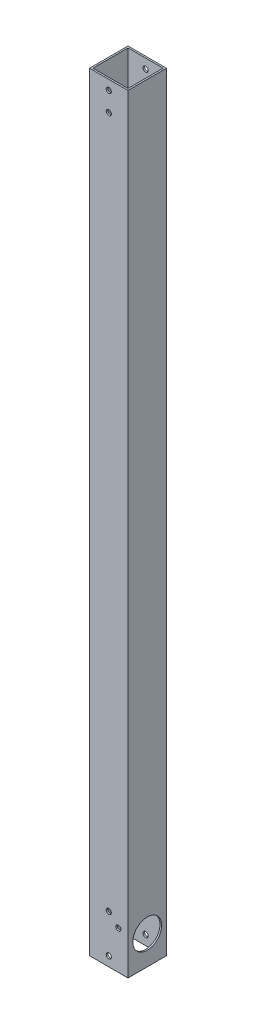
ISO-10303-21;
HEADER;
FILE_DESCRIPTION(('STEP AP214'),'2;1');
FILE_NAME('part.step','',(''),(''),'','','');
FILE_SCHEMA(('AUTOMOTIVE_DESIGN { 1 0 10303 214 1 1 1 1 }'));
ENDSEC;
DATA;
#1=APPLICATION_CONTEXT('core data for automotive mechanical design processes');
#2=APPLICATION_PROTOCOL_DEFINITION('international standard','automotive_design',2000,#1);
#3=PRODUCT_CONTEXT('',#1,'mechanical');
#4=PRODUCT('Part','Part','',(#3));
#5=PRODUCT_RELATED_PRODUCT_CATEGORY('part','',(#4));
#6=PRODUCT_DEFINITION_FORMATION('','',#4);
#7=PRODUCT_DEFINITION_CONTEXT('part definition',#1,'design');
#8=PRODUCT_DEFINITION('design','',#6,#7);
#9=PRODUCT_DEFINITION_SHAPE('','',#8);
#10=(LENGTH_UNIT() NAMED_UNIT(*) SI_UNIT(.MILLI.,.METRE.));
#11=(NAMED_UNIT(*) PLANE_ANGLE_UNIT() SI_UNIT($,.RADIAN.));
#12=(NAMED_UNIT(*) SI_UNIT($,.STERADIAN.) SOLID_ANGLE_UNIT());
#13=UNCERTAINTY_MEASURE_WITH_UNIT(LENGTH_MEASURE(1.E-05),#10,'distance_accuracy_value','');
#14=(GEOMETRIC_REPRESENTATION_CONTEXT(3) GLOBAL_UNCERTAINTY_ASSIGNED_CONTEXT((#13)) GLOBAL_UNIT_ASSIGNED_CONTEXT((#10,
#11,#12)) REPRESENTATION_CONTEXT('',''));
#15=CARTESIAN_POINT('',(0.,0.,0.));
#16=DIRECTION('',(0.,0.,1.));
#17=DIRECTION('',(1.,0.,0.));
#18=AXIS2_PLACEMENT_3D('',#15,#16,#17);
#19=CARTESIAN_POINT('',(-3.89865254481119,28.575,-19.05));
#20=DIRECTION('',(1.,0.,0.));
#21=DIRECTION('',(0.,0.,-1.));
#22=AXIS2_PLACEMENT_3D('',#19,#20,#21);
#23=CYLINDRICAL_SURFACE('',#22,14.2875);
#24=CARTESIAN_POINT('',(38.1,28.575,-19.05));
#25=DIRECTION('',(1.,0.,0.));
#26=DIRECTION('',(0.,0.,-1.));
#27=AXIS2_PLACEMENT_3D('',#24,#25,#26);
#28=CIRCLE('',#27,14.2875);
#29=CARTESIAN_POINT('',(38.1,28.575,-33.3375));
#30=VERTEX_POINT('',#29);
#31=EDGE_CURVE('E298',#30,#30,#28,.T.);
#32=ORIENTED_EDGE('',*,*,#31,.T.);
#33=EDGE_LOOP('',(#32));
#34=FACE_BOUND('',#33,.T.);
#35=CARTESIAN_POINT('',(36.5125,28.575,-19.05));
#36=DIRECTION('',(1.,0.,0.));
#37=DIRECTION('',(0.,0.,1.));
#38=AXIS2_PLACEMENT_3D('',#35,#36,#37);
#39=CIRCLE('',#38,14.2875);
#40=CARTESIAN_POINT('',(36.5125,28.575,-4.7625));
#41=VERTEX_POINT('',#40);
#42=EDGE_CURVE('E330',#41,#41,#39,.T.);
#43=ORIENTED_EDGE('',*,*,#42,.F.);
#44=EDGE_LOOP('',(#43));
#45=FACE_BOUND('',#44,.T.);
#46=ADVANCED_FACE('F17',(#34,#45),#23,.F.);
#47=CARTESIAN_POINT('',(19.05,9.525,-38.1));
#48=DIRECTION('',(0.,0.,1.));
#49=DIRECTION('',(1.,0.,0.));
#50=AXIS2_PLACEMENT_3D('',#47,#48,#49);
#51=CYLINDRICAL_SURFACE('',#50,2.5527);
#52=CARTESIAN_POINT('',(19.05,9.525,-1.5875));
#53=DIRECTION('',(0.,0.,-1.));
#54=DIRECTION('',(-1.,0.,0.));
#55=AXIS2_PLACEMENT_3D('',#52,#53,#54);
#56=CIRCLE('',#55,2.5527);
#57=CARTESIAN_POINT('',(16.4973,9.525,-1.5875));
#58=VERTEX_POINT('',#57);
#59=EDGE_CURVE('E312',#58,#58,#56,.T.);
#60=ORIENTED_EDGE('',*,*,#59,.T.);
#61=EDGE_LOOP('',(#60));
#62=FACE_BOUND('',#61,.T.);
#63=CARTESIAN_POINT('',(19.05,9.525,0.));
#64=DIRECTION('',(0.,0.,1.));
#65=DIRECTION('',(1.,0.,0.));
#66=AXIS2_PLACEMENT_3D('',#63,#64,#65);
#67=CIRCLE('',#66,2.5527);
#68=CARTESIAN_POINT('',(21.6027,9.525,0.));
#69=VERTEX_POINT('',#68);
#70=EDGE_CURVE('E275',#69,#69,#67,.T.);
#71=ORIENTED_EDGE('',*,*,#70,.T.);
#72=EDGE_LOOP('',(#71));
#73=FACE_BOUND('',#72,.T.);
#74=ADVANCED_FACE('F558',(#62,#73),#51,.F.);
#75=CARTESIAN_POINT('',(19.05,47.625,-38.1));
#76=DIRECTION('',(0.,0.,1.));
#77=DIRECTION('',(1.,0.,0.));
#78=AXIS2_PLACEMENT_3D('',#75,#76,#77);
#79=CYLINDRICAL_SURFACE('',#78,2.5527);
#80=CARTESIAN_POINT('',(19.05,47.625,-1.5875));
#81=DIRECTION('',(0.,0.,-1.));
#82=DIRECTION('',(-1.,0.,0.));
#83=AXIS2_PLACEMENT_3D('',#80,#81,#82);
#84=CIRCLE('',#83,2.5527);
#85=CARTESIAN_POINT('',(16.4973,47.625,-1.5875));
#86=VERTEX_POINT('',#85);
#87=EDGE_CURVE('E315',#86,#86,#84,.T.);
#88=ORIENTED_EDGE('',*,*,#87,.T.);
#89=EDGE_LOOP('',(#88));
#90=FACE_BOUND('',#89,.T.);
#91=CARTESIAN_POINT('',(19.05,47.625,0.));
#92=DIRECTION('',(0.,0.,1.));
#93=DIRECTION('',(1.,0.,0.));
#94=AXIS2_PLACEMENT_3D('',#91,#92,#93);
#95=CIRCLE('',#94,2.5527);
#96=CARTESIAN_POINT('',(21.6027,47.625,0.));
#97=VERTEX_POINT('',#96);
#98=EDGE_CURVE('E278',#97,#97,#95,.T.);
#99=ORIENTED_EDGE('',*,*,#98,.T.);
#100=EDGE_LOOP('',(#99));
#101=FACE_BOUND('',#100,.T.);
#102=ADVANCED_FACE('F548',(#90,#101),#79,.F.);
#103=CARTESIAN_POINT('',(28.575,38.1,-38.1));
#104=DIRECTION('',(0.,0.,1.));
#105=DIRECTION('',(1.,0.,0.));
#106=AXIS2_PLACEMENT_3D('',#103,#104,#105);
#107=CYLINDRICAL_SURFACE('',#106,2.5527);
#108=CARTESIAN_POINT('',(28.575,38.1,-1.5875));
#109=DIRECTION('',(0.,0.,-1.));
#110=DIRECTION('',(-1.,0.,0.));
#111=AXIS2_PLACEMENT_3D('',#108,#109,#110);
#112=CIRCLE('',#111,2.5527);
#113=CARTESIAN_POINT('',(26.0223,38.1,-1.5875));
#114=VERTEX_POINT('',#113);
#115=EDGE_CURVE('E318',#114,#114,#112,.T.);
#116=ORIENTED_EDGE('',*,*,#115,.T.);
#117=EDGE_LOOP('',(#116));
#118=FACE_BOUND('',#117,.T.);
#119=CARTESIAN_POINT('',(28.575,38.1,0.));
#120=DIRECTION('',(0.,0.,1.));
#121=DIRECTION('',(1.,0.,0.));
#122=AXIS2_PLACEMENT_3D('',#119,#120,#121);
#123=CIRCLE('',#122,2.5527);
#124=CARTESIAN_POINT('',(31.1277,38.1,0.));
#125=VERTEX_POINT('',#124);
#126=EDGE_CURVE('E286',#125,#125,#123,.T.);
#127=ORIENTED_EDGE('',*,*,#126,.T.);
#128=EDGE_LOOP('',(#127));
#129=FACE_BOUND('',#128,.T.);
#130=ADVANCED_FACE('F537',(#118,#129),#107,.F.);
#131=CARTESIAN_POINT('',(19.05,752.475,-38.1));
#132=DIRECTION('',(0.,0.,1.));
#133=DIRECTION('',(1.,0.,0.));
#134=AXIS2_PLACEMENT_3D('',#131,#132,#133);
#135=CYLINDRICAL_SURFACE('',#134,2.5527);
#136=CARTESIAN_POINT('',(19.05,752.475,-1.5875));
#137=DIRECTION('',(0.,0.,-1.));
#138=DIRECTION('',(-1.,0.,0.));
#139=AXIS2_PLACEMENT_3D('',#136,#137,#138);
#140=CIRCLE('',#139,2.5527);
#141=CARTESIAN_POINT('',(16.4973,752.475,-1.5875));
#142=VERTEX_POINT('',#141);
#143=EDGE_CURVE('E321',#142,#142,#140,.T.);
#144=ORIENTED_EDGE('',*,*,#143,.T.);
#145=EDGE_LOOP('',(#144));
#146=FACE_BOUND('',#145,.T.);
#147=CARTESIAN_POINT('',(19.05,752.475,0.));
#148=DIRECTION('',(0.,0.,1.));
#149=DIRECTION('',(1.,0.,0.));
#150=AXIS2_PLACEMENT_3D('',#147,#148,#149);
#151=CIRCLE('',#150,2.5527);
#152=CARTESIAN_POINT('',(21.6027,752.475,0.));
#153=VERTEX_POINT('',#152);
#154=EDGE_CURVE('E289',#153,#153,#151,.T.);
#155=ORIENTED_EDGE('',*,*,#154,.T.);
#156=EDGE_LOOP('',(#155));
#157=FACE_BOUND('',#156,.T.);
#158=ADVANCED_FACE('F527',(#146,#157),#135,.F.);
#159=CARTESIAN_POINT('',(19.05,733.425,-38.1));
#160=DIRECTION('',(0.,0.,1.));
#161=DIRECTION('',(1.,0.,0.));
#162=AXIS2_PLACEMENT_3D('',#159,#160,#161);
#163=CYLINDRICAL_SURFACE('',#162,2.5527);
#164=CARTESIAN_POINT('',(19.05,733.425,-1.5875));
#165=DIRECTION('',(0.,0.,-1.));
#166=DIRECTION('',(-1.,0.,0.));
#167=AXIS2_PLACEMENT_3D('',#164,#165,#166);
#168=CIRCLE('',#167,2.5527);
#169=CARTESIAN_POINT('',(16.4973,733.425,-1.5875));
#170=VERTEX_POINT('',#169);
#171=EDGE_CURVE('E324',#170,#170,#168,.T.);
#172=ORIENTED_EDGE('',*,*,#171,.T.);
#173=EDGE_LOOP('',(#172));
#174=FACE_BOUND('',#173,.T.);
#175=CARTESIAN_POINT('',(19.05,733.425,0.));
#176=DIRECTION('',(0.,0.,1.));
#177=DIRECTION('',(1.,0.,0.));
#178=AXIS2_PLACEMENT_3D('',#175,#176,#177);
#179=CIRCLE('',#178,2.5527);
#180=CARTESIAN_POINT('',(21.6027,733.425,0.));
#181=VERTEX_POINT('',#180);
#182=EDGE_CURVE('E292',#181,#181,#179,.T.);
#183=ORIENTED_EDGE('',*,*,#182,.T.);
#184=EDGE_LOOP('',(#183));
#185=FACE_BOUND('',#184,.T.);
#186=ADVANCED_FACE('F517',(#174,#185),#163,.F.);
#187=CARTESIAN_POINT('',(19.05,9.525,-38.1));
#188=DIRECTION('',(0.,0.,1.));
#189=DIRECTION('',(1.,0.,0.));
#190=AXIS2_PLACEMENT_3D('',#187,#188,#189);
#191=CYLINDRICAL_SURFACE('',#190,2.5527);
#192=CARTESIAN_POINT('',(19.05,9.525,-36.5125));
#193=DIRECTION('',(0.,0.,1.));
#194=DIRECTION('',(1.,0.,0.));
#195=AXIS2_PLACEMENT_3D('',#192,#193,#194);
#196=CIRCLE('',#195,2.5527);
#197=CARTESIAN_POINT('',(21.6027,9.525,-36.5125));
#198=VERTEX_POINT('',#197);
#199=EDGE_CURVE('E331',#198,#198,#196,.T.);
#200=ORIENTED_EDGE('',*,*,#199,.T.);
#201=EDGE_LOOP('',(#200));
#202=FACE_BOUND('',#201,.T.);
#203=CARTESIAN_POINT('',(19.05,9.525,-38.1));
#204=DIRECTION('',(0.,0.,1.));
#205=DIRECTION('',(1.,0.,0.));
#206=AXIS2_PLACEMENT_3D('',#203,#204,#205);
#207=CIRCLE('',#206,2.5527);
#208=CARTESIAN_POINT('',(21.6027,9.525,-38.1));
#209=VERTEX_POINT('',#208);
#210=EDGE_CURVE('E234',#209,#209,#207,.T.);
#211=ORIENTED_EDGE('',*,*,#210,.F.);
#212=EDGE_LOOP('',(#211));
#213=FACE_BOUND('',#212,.T.);
#214=ADVANCED_FACE('F507',(#202,#213),#191,.F.);
#215=CARTESIAN_POINT('',(19.05,47.625,-38.1));
#216=DIRECTION('',(0.,0.,1.));
#217=DIRECTION('',(1.,0.,0.));
#218=AXIS2_PLACEMENT_3D('',#215,#216,#217);
#219=CYLINDRICAL_SURFACE('',#218,2.5527);
#220=CARTESIAN_POINT('',(19.05,47.625,-36.5125));
#221=DIRECTION('',(0.,0.,1.));
#222=DIRECTION('',(1.,0.,0.));
#223=AXIS2_PLACEMENT_3D('',#220,#221,#222);
#224=CIRCLE('',#223,2.5527);
#225=CARTESIAN_POINT('',(21.6027,47.625,-36.5125));
#226=VERTEX_POINT('',#225);
#227=EDGE_CURVE('E334',#226,#226,#224,.T.);
#228=ORIENTED_EDGE('',*,*,#227,.T.);
#229=EDGE_LOOP('',(#228));
#230=FACE_BOUND('',#229,.T.);
#231=CARTESIAN_POINT('',(19.05,47.625,-38.1));
#232=DIRECTION('',(0.,0.,1.));
#233=DIRECTION('',(1.,0.,0.));
#234=AXIS2_PLACEMENT_3D('',#231,#232,#233);
#235=CIRCLE('',#234,2.5527);
#236=CARTESIAN_POINT('',(21.6027,47.625,-38.1));
#237=VERTEX_POINT('',#236);
#238=EDGE_CURVE('E230',#237,#237,#235,.T.);
#239=ORIENTED_EDGE('',*,*,#238,.F.);
#240=EDGE_LOOP('',(#239));
#241=FACE_BOUND('',#240,.T.);
#242=ADVANCED_FACE('F497',(#230,#241),#219,.F.);
#243=CARTESIAN_POINT('',(28.575,38.1,-38.1));
#244=DIRECTION('',(0.,0.,1.));
#245=DIRECTION('',(1.,0.,0.));
#246=AXIS2_PLACEMENT_3D('',#243,#244,#245);
#247=CYLINDRICAL_SURFACE('',#246,2.5527);
#248=CARTESIAN_POINT('',(28.575,38.1,-36.5125));
#249=DIRECTION('',(0.,0.,1.));
#250=DIRECTION('',(1.,0.,0.));
#251=AXIS2_PLACEMENT_3D('',#248,#249,#250);
#252=CIRCLE('',#251,2.5527);
#253=CARTESIAN_POINT('',(31.1277,38.1,-36.5125));
#254=VERTEX_POINT('',#253);
#255=EDGE_CURVE('E341',#254,#254,#252,.T.);
#256=ORIENTED_EDGE('',*,*,#255,.T.);
#257=EDGE_LOOP('',(#256));
#258=FACE_BOUND('',#257,.T.);
#259=CARTESIAN_POINT('',(28.575,38.1,-38.1));
#260=DIRECTION('',(0.,0.,1.));
#261=DIRECTION('',(1.,0.,0.));
#262=AXIS2_PLACEMENT_3D('',#259,#260,#261);
#263=CIRCLE('',#262,2.5527);
#264=CARTESIAN_POINT('',(31.1277,38.1,-38.1));
#265=VERTEX_POINT('',#264);
#266=EDGE_CURVE('E233',#265,#265,#263,.T.);
#267=ORIENTED_EDGE('',*,*,#266,.F.);
#268=EDGE_LOOP('',(#267));
#269=FACE_BOUND('',#268,.T.);
#270=ADVANCED_FACE('F488',(#258,#269),#247,.F.);
#271=CARTESIAN_POINT('',(19.05,752.475,-38.1));
#272=DIRECTION('',(0.,0.,1.));
#273=DIRECTION('',(1.,0.,0.));
#274=AXIS2_PLACEMENT_3D('',#271,#272,#273);
#275=CYLINDRICAL_SURFACE('',#274,2.5527);
#276=CARTESIAN_POINT('',(19.05,752.475,-36.5125));
#277=DIRECTION('',(0.,0.,1.));
#278=DIRECTION('',(1.,0.,0.));
#279=AXIS2_PLACEMENT_3D('',#276,#277,#278);
#280=CIRCLE('',#279,2.5527);
#281=CARTESIAN_POINT('',(21.6027,752.475,-36.5125));
#282=VERTEX_POINT('',#281);
#283=EDGE_CURVE('E20',#282,#282,#280,.T.);
#284=ORIENTED_EDGE('',*,*,#283,.T.);
#285=EDGE_LOOP('',(#284));
#286=FACE_BOUND('',#285,.T.);
#287=CARTESIAN_POINT('',(19.05,752.475,-38.1));
#288=DIRECTION('',(0.,0.,1.));
#289=DIRECTION('',(1.,0.,0.));
#290=AXIS2_PLACEMENT_3D('',#287,#288,#289);
#291=CIRCLE('',#290,2.5527);
#292=CARTESIAN_POINT('',(21.6027,752.475,-38.1));
#293=VERTEX_POINT('',#292);
#294=EDGE_CURVE('E299',#293,#293,#291,.T.);
#295=ORIENTED_EDGE('',*,*,#294,.F.);
#296=EDGE_LOOP('',(#295));
#297=FACE_BOUND('',#296,.T.);
#298=ADVANCED_FACE('F478',(#286,#297),#275,.F.);
#299=CARTESIAN_POINT('',(19.05,733.425,-38.1));
#300=DIRECTION('',(0.,0.,1.));
#301=DIRECTION('',(1.,0.,0.));
#302=AXIS2_PLACEMENT_3D('',#299,#300,#301);
#303=CYLINDRICAL_SURFACE('',#302,2.5527);
#304=CARTESIAN_POINT('',(19.05,733.425,-36.5125));
#305=DIRECTION('',(0.,0.,1.));
#306=DIRECTION('',(1.,0.,0.));
#307=AXIS2_PLACEMENT_3D('',#304,#305,#306);
#308=CIRCLE('',#307,2.5527);
#309=CARTESIAN_POINT('',(21.6027,733.425,-36.5125));
#310=VERTEX_POINT('',#309);
#311=EDGE_CURVE('E11',#310,#310,#308,.T.);
#312=ORIENTED_EDGE('',*,*,#311,.T.);
#313=EDGE_LOOP('',(#312));
#314=FACE_BOUND('',#313,.T.);
#315=CARTESIAN_POINT('',(19.05,733.425,-38.1));
#316=DIRECTION('',(0.,0.,1.));
#317=DIRECTION('',(1.,0.,0.));
#318=AXIS2_PLACEMENT_3D('',#315,#316,#317);
#319=CIRCLE('',#318,2.5527);
#320=CARTESIAN_POINT('',(21.6027,733.425,-38.1));
#321=VERTEX_POINT('',#320);
#322=EDGE_CURVE('E283',#321,#321,#319,.T.);
#323=ORIENTED_EDGE('',*,*,#322,.F.);
#324=EDGE_LOOP('',(#323));
#325=FACE_BOUND('',#324,.T.);
#326=ADVANCED_FACE('F466',(#314,#325),#303,.F.);
#327=CARTESIAN_POINT('',(1.5875,762.,-1.5875));
#328=DIRECTION('',(1.,0.,0.));
#329=DIRECTION('',(0.,1.,0.));
#330=AXIS2_PLACEMENT_3D('',#327,#328,#329);
#331=PLANE('',#330);
#332=DIRECTION('',(0.,0.,1.));
#333=VECTOR('',#332,1.);
#334=CARTESIAN_POINT('',(1.5875,0.,-1.5875));
#335=LINE('',#334,#333);
#336=CARTESIAN_POINT('',(1.5875,0.,-36.5125));
#337=VERTEX_POINT('',#336);
#338=CARTESIAN_POINT('',(1.5875,0.,-1.5875));
#339=VERTEX_POINT('',#338);
#340=EDGE_CURVE('E267',#337,#339,#335,.T.);
#341=ORIENTED_EDGE('',*,*,#340,.F.);
#342=DIRECTION('',(0.,-1.,0.));
#343=VECTOR('',#342,1.);
#344=CARTESIAN_POINT('',(1.5875,762.,-36.5125));
#345=LINE('',#344,#343);
#346=CARTESIAN_POINT('',(1.5875,762.,-36.5125));
#347=VERTEX_POINT('',#346);
#348=EDGE_CURVE('E335',#347,#337,#345,.T.);
#349=ORIENTED_EDGE('',*,*,#348,.F.);
#350=DIRECTION('',(0.,0.,1.));
#351=VECTOR('',#350,1.);
#352=CARTESIAN_POINT('',(1.5875,762.,-1.5875));
#353=LINE('',#352,#351);
#354=CARTESIAN_POINT('',(1.5875,762.,-1.5875));
#355=VERTEX_POINT('',#354);
#356=EDGE_CURVE('E227',#347,#355,#353,.T.);
#357=ORIENTED_EDGE('',*,*,#356,.T.);
#358=DIRECTION('',(0.,-1.,0.));
#359=VECTOR('',#358,1.);
#360=CARTESIAN_POINT('',(1.5875,762.,-1.5875));
#361=LINE('',#360,#359);
#362=EDGE_CURVE('E279',#355,#339,#361,.T.);
#363=ORIENTED_EDGE('',*,*,#362,.T.);
#364=EDGE_LOOP('',(#341,#349,#357,#363));
#365=FACE_BOUND('',#364,.T.);
#366=ADVANCED_FACE('F454',(#365),#331,.T.);
#367=CARTESIAN_POINT('',(1.5875,762.,-36.5125));
#368=DIRECTION('',(0.,0.,1.));
#369=DIRECTION('',(1.,0.,0.));
#370=AXIS2_PLACEMENT_3D('',#367,#368,#369);
#371=PLANE('',#370);
#372=ORIENTED_EDGE('',*,*,#311,.F.);
#373=EDGE_LOOP('',(#372));
#374=FACE_BOUND('',#373,.T.);
#375=ORIENTED_EDGE('',*,*,#283,.F.);
#376=EDGE_LOOP('',(#375));
#377=FACE_BOUND('',#376,.T.);
#378=ORIENTED_EDGE('',*,*,#255,.F.);
#379=EDGE_LOOP('',(#378));
#380=FACE_BOUND('',#379,.T.);
#381=ORIENTED_EDGE('',*,*,#227,.F.);
#382=EDGE_LOOP('',(#381));
#383=FACE_BOUND('',#382,.T.);
#384=ORIENTED_EDGE('',*,*,#199,.F.);
#385=EDGE_LOOP('',(#384));
#386=FACE_BOUND('',#385,.T.);
#387=DIRECTION('',(-1.,0.,0.));
#388=VECTOR('',#387,1.);
#389=CARTESIAN_POINT('',(1.5875,0.,-36.5125));
#390=LINE('',#389,#388);
#391=CARTESIAN_POINT('',(36.5125,0.,-36.5125));
#392=VERTEX_POINT('',#391);
#393=EDGE_CURVE('E245',#392,#337,#390,.T.);
#394=ORIENTED_EDGE('',*,*,#393,.F.);
#395=DIRECTION('',(0.,-1.,0.));
#396=VECTOR('',#395,1.);
#397=CARTESIAN_POINT('',(36.5125,762.,-36.5125));
#398=LINE('',#397,#396);
#399=CARTESIAN_POINT('',(36.5125,762.,-36.5125));
#400=VERTEX_POINT('',#399);
#401=EDGE_CURVE('E327',#400,#392,#398,.T.);
#402=ORIENTED_EDGE('',*,*,#401,.F.);
#403=DIRECTION('',(-1.,0.,0.));
#404=VECTOR('',#403,1.);
#405=CARTESIAN_POINT('',(1.5875,762.,-36.5125));
#406=LINE('',#405,#404);
#407=EDGE_CURVE('E235',#400,#347,#406,.T.);
#408=ORIENTED_EDGE('',*,*,#407,.T.);
#409=ORIENTED_EDGE('',*,*,#348,.T.);
#410=EDGE_LOOP('',(#394,#402,#408,#409));
#411=FACE_BOUND('',#410,.T.);
#412=ADVANCED_FACE('F443',(#374,#377,#380,#383,#386,#411),#371,.T.);
#413=CARTESIAN_POINT('',(36.5125,762.,-1.5875));
#414=DIRECTION('',(-1.,0.,0.));
#415=DIRECTION('',(0.,0.,1.));
#416=AXIS2_PLACEMENT_3D('',#413,#414,#415);
#417=PLANE('',#416);
#418=ORIENTED_EDGE('',*,*,#42,.T.);
#419=EDGE_LOOP('',(#418));
#420=FACE_BOUND('',#419,.T.);
#421=DIRECTION('',(0.,0.,-1.));
#422=VECTOR('',#421,1.);
#423=CARTESIAN_POINT('',(36.5125,0.,-1.5875));
#424=LINE('',#423,#422);
#425=CARTESIAN_POINT('',(36.5125,0.,-1.5875));
#426=VERTEX_POINT('',#425);
#427=EDGE_CURVE('E249',#426,#392,#424,.T.);
#428=ORIENTED_EDGE('',*,*,#427,.F.);
#429=DIRECTION('',(0.,-1.,0.));
#430=VECTOR('',#429,1.);
#431=CARTESIAN_POINT('',(36.5125,762.,-1.5875));
#432=LINE('',#431,#430);
#433=CARTESIAN_POINT('',(36.5125,762.,-1.5875));
#434=VERTEX_POINT('',#433);
#435=EDGE_CURVE('E282',#434,#426,#432,.T.);
#436=ORIENTED_EDGE('',*,*,#435,.F.);
#437=DIRECTION('',(0.,0.,-1.));
#438=VECTOR('',#437,1.);
#439=CARTESIAN_POINT('',(36.5125,762.,-1.5875));
#440=LINE('',#439,#438);
#441=EDGE_CURVE('E239',#434,#400,#440,.T.);
#442=ORIENTED_EDGE('',*,*,#441,.T.);
#443=ORIENTED_EDGE('',*,*,#401,.T.);
#444=EDGE_LOOP('',(#428,#436,#442,#443));
#445=FACE_BOUND('',#444,.T.);
#446=ADVANCED_FACE('F432',(#420,#445),#417,.T.);
#447=CARTESIAN_POINT('',(1.5875,762.,-1.5875));
#448=DIRECTION('',(0.,0.,-1.));
#449=DIRECTION('',(0.,-1.,0.));
#450=AXIS2_PLACEMENT_3D('',#447,#448,#449);
#451=PLANE('',#450);
#452=ORIENTED_EDGE('',*,*,#171,.F.);
#453=EDGE_LOOP('',(#452));
#454=FACE_BOUND('',#453,.T.);
#455=ORIENTED_EDGE('',*,*,#143,.F.);
#456=EDGE_LOOP('',(#455));
#457=FACE_BOUND('',#456,.T.);
#458=ORIENTED_EDGE('',*,*,#115,.F.);
#459=EDGE_LOOP('',(#458));
#460=FACE_BOUND('',#459,.T.);
#461=ORIENTED_EDGE('',*,*,#87,.F.);
#462=EDGE_LOOP('',(#461));
#463=FACE_BOUND('',#462,.T.);
#464=ORIENTED_EDGE('',*,*,#59,.F.);
#465=EDGE_LOOP('',(#464));
#466=FACE_BOUND('',#465,.T.);
#467=DIRECTION('',(1.,0.,0.));
#468=VECTOR('',#467,1.);
#469=CARTESIAN_POINT('',(1.5875,0.,-1.5875));
#470=LINE('',#469,#468);
#471=EDGE_CURVE('E266',#339,#426,#470,.T.);
#472=ORIENTED_EDGE('',*,*,#471,.F.);
#473=ORIENTED_EDGE('',*,*,#362,.F.);
#474=DIRECTION('',(1.,0.,0.));
#475=VECTOR('',#474,1.);
#476=CARTESIAN_POINT('',(1.5875,762.,-1.5875));
#477=LINE('',#476,#475);
#478=EDGE_CURVE('E214',#355,#434,#477,.T.);
#479=ORIENTED_EDGE('',*,*,#478,.T.);
#480=ORIENTED_EDGE('',*,*,#435,.T.);
#481=EDGE_LOOP('',(#472,#473,#479,#480));
#482=FACE_BOUND('',#481,.T.);
#483=ADVANCED_FACE('F420',(#454,#457,#460,#463,#466,#482),#451,.T.);
#484=CARTESIAN_POINT('',(0.,762.,-38.1));
#485=DIRECTION('',(0.,0.,1.));
#486=DIRECTION('',(1.,0.,0.));
#487=AXIS2_PLACEMENT_3D('',#484,#485,#486);
#488=PLANE('',#487);
#489=ORIENTED_EDGE('',*,*,#322,.T.);
#490=EDGE_LOOP('',(#489));
#491=FACE_BOUND('',#490,.T.);
#492=ORIENTED_EDGE('',*,*,#294,.T.);
#493=EDGE_LOOP('',(#492));
#494=FACE_BOUND('',#493,.T.);
#495=ORIENTED_EDGE('',*,*,#266,.T.);
#496=EDGE_LOOP('',(#495));
#497=FACE_BOUND('',#496,.T.);
#498=ORIENTED_EDGE('',*,*,#238,.T.);
#499=EDGE_LOOP('',(#498));
#500=FACE_BOUND('',#499,.T.);
#501=ORIENTED_EDGE('',*,*,#210,.T.);
#502=EDGE_LOOP('',(#501));
#503=FACE_BOUND('',#502,.T.);
#504=DIRECTION('',(-1.,0.,0.));
#505=VECTOR('',#504,1.);
#506=CARTESIAN_POINT('',(0.,0.,-38.1));
#507=LINE('',#506,#505);
#508=CARTESIAN_POINT('',(38.1,0.,-38.1));
#509=VERTEX_POINT('',#508);
#510=CARTESIAN_POINT('',(0.,0.,-38.1));
#511=VERTEX_POINT('',#510);
#512=EDGE_CURVE('E197',#509,#511,#507,.T.);
#513=ORIENTED_EDGE('',*,*,#512,.T.);
#514=DIRECTION('',(0.,-1.,0.));
#515=VECTOR('',#514,1.);
#516=CARTESIAN_POINT('',(0.,762.,-38.1));
#517=LINE('',#516,#515);
#518=CARTESIAN_POINT('',(0.,762.,-38.1));
#519=VERTEX_POINT('',#518);
#520=EDGE_CURVE('E191',#519,#511,#517,.T.);
#521=ORIENTED_EDGE('',*,*,#520,.F.);
#522=DIRECTION('',(-1.,0.,0.));
#523=VECTOR('',#522,1.);
#524=CARTESIAN_POINT('',(0.,762.,-38.1));
#525=LINE('',#524,#523);
#526=CARTESIAN_POINT('',(38.1,762.,-38.1));
#527=VERTEX_POINT('',#526);
#528=EDGE_CURVE('E194',#527,#519,#525,.T.);
#529=ORIENTED_EDGE('',*,*,#528,.F.);
#530=DIRECTION('',(0.,-1.,0.));
#531=VECTOR('',#530,1.);
#532=CARTESIAN_POINT('',(38.1,762.,-38.1));
#533=LINE('',#532,#531);
#534=EDGE_CURVE('E295',#527,#509,#533,.T.);
#535=ORIENTED_EDGE('',*,*,#534,.T.);
#536=EDGE_LOOP('',(#513,#521,#529,#535));
#537=FACE_BOUND('',#536,.T.);
#538=ADVANCED_FACE('F193',(#491,#494,#497,#500,#503,#537),#488,.F.);
#539=CARTESIAN_POINT('',(38.1,762.,0.));
#540=DIRECTION('',(-1.,0.,0.));
#541=DIRECTION('',(0.,0.,1.));
#542=AXIS2_PLACEMENT_3D('',#539,#540,#541);
#543=PLANE('',#542);
#544=ORIENTED_EDGE('',*,*,#31,.F.);
#545=EDGE_LOOP('',(#544));
#546=FACE_BOUND('',#545,.T.);
#547=DIRECTION('',(0.,0.,-1.));
#548=VECTOR('',#547,1.);
#549=CARTESIAN_POINT('',(38.1,0.,0.));
#550=LINE('',#549,#548);
#551=CARTESIAN_POINT('',(38.1,0.,0.));
#552=VERTEX_POINT('',#551);
#553=EDGE_CURVE('E258',#552,#509,#550,.T.);
#554=ORIENTED_EDGE('',*,*,#553,.T.);
#555=ORIENTED_EDGE('',*,*,#534,.F.);
#556=DIRECTION('',(0.,0.,-1.));
#557=VECTOR('',#556,1.);
#558=CARTESIAN_POINT('',(38.1,762.,0.));
#559=LINE('',#558,#557);
#560=CARTESIAN_POINT('',(38.1,762.,0.));
#561=VERTEX_POINT('',#560);
#562=EDGE_CURVE('E212',#561,#527,#559,.T.);
#563=ORIENTED_EDGE('',*,*,#562,.F.);
#564=DIRECTION('',(0.,-1.,0.));
#565=VECTOR('',#564,1.);
#566=CARTESIAN_POINT('',(38.1,762.,0.));
#567=LINE('',#566,#565);
#568=EDGE_CURVE('E203',#561,#552,#567,.T.);
#569=ORIENTED_EDGE('',*,*,#568,.T.);
#570=EDGE_LOOP('',(#554,#555,#563,#569));
#571=FACE_BOUND('',#570,.T.);
#572=ADVANCED_FACE('F399',(#546,#571),#543,.F.);
#573=CARTESIAN_POINT('',(0.,762.,0.));
#574=DIRECTION('',(0.,0.,-1.));
#575=DIRECTION('',(0.,-1.,0.));
#576=AXIS2_PLACEMENT_3D('',#573,#574,#575);
#577=PLANE('',#576);
#578=ORIENTED_EDGE('',*,*,#182,.F.);
#579=EDGE_LOOP('',(#578));
#580=FACE_BOUND('',#579,.T.);
#581=ORIENTED_EDGE('',*,*,#154,.F.);
#582=EDGE_LOOP('',(#581));
#583=FACE_BOUND('',#582,.T.);
#584=ORIENTED_EDGE('',*,*,#126,.F.);
#585=EDGE_LOOP('',(#584));
#586=FACE_BOUND('',#585,.T.);
#587=ORIENTED_EDGE('',*,*,#98,.F.);
#588=EDGE_LOOP('',(#587));
#589=FACE_BOUND('',#588,.T.);
#590=ORIENTED_EDGE('',*,*,#70,.F.);
#591=EDGE_LOOP('',(#590));
#592=FACE_BOUND('',#591,.T.);
#593=DIRECTION('',(1.,0.,0.));
#594=VECTOR('',#593,1.);
#595=CARTESIAN_POINT('',(0.,0.,0.));
#596=LINE('',#595,#594);
#597=CARTESIAN_POINT('',(0.,0.,0.));
#598=VERTEX_POINT('',#597);
#599=EDGE_CURVE('E262',#598,#552,#596,.T.);
#600=ORIENTED_EDGE('',*,*,#599,.T.);
#601=ORIENTED_EDGE('',*,*,#568,.F.);
#602=DIRECTION('',(1.,0.,0.));
#603=VECTOR('',#602,1.);
#604=CARTESIAN_POINT('',(0.,762.,0.));
#605=LINE('',#604,#603);
#606=CARTESIAN_POINT('',(0.,762.,0.));
#607=VERTEX_POINT('',#606);
#608=EDGE_CURVE('E219',#607,#561,#605,.T.);
#609=ORIENTED_EDGE('',*,*,#608,.F.);
#610=DIRECTION('',(0.,-1.,0.));
#611=VECTOR('',#610,1.);
#612=CARTESIAN_POINT('',(0.,762.,0.));
#613=LINE('',#612,#611);
#614=EDGE_CURVE('E204',#607,#598,#613,.T.);
#615=ORIENTED_EDGE('',*,*,#614,.T.);
#616=EDGE_LOOP('',(#600,#601,#609,#615));
#617=FACE_BOUND('',#616,.T.);
#618=ADVANCED_FACE('F389',(#580,#583,#586,#589,#592,#617),#577,.F.);
#619=CARTESIAN_POINT('',(0.,762.,0.));
#620=DIRECTION('',(1.,0.,0.));
#621=DIRECTION('',(0.,1.,0.));
#622=AXIS2_PLACEMENT_3D('',#619,#620,#621);
#623=PLANE('',#622);
#624=DIRECTION('',(0.,0.,1.));
#625=VECTOR('',#624,1.);
#626=CARTESIAN_POINT('',(0.,0.,0.));
#627=LINE('',#626,#625);
#628=EDGE_CURVE('E240',#511,#598,#627,.T.);
#629=ORIENTED_EDGE('',*,*,#628,.T.);
#630=ORIENTED_EDGE('',*,*,#614,.F.);
#631=DIRECTION('',(0.,0.,1.));
#632=VECTOR('',#631,1.);
#633=CARTESIAN_POINT('',(0.,762.,0.));
#634=LINE('',#633,#632);
#635=EDGE_CURVE('E210',#519,#607,#634,.T.);
#636=ORIENTED_EDGE('',*,*,#635,.F.);
#637=ORIENTED_EDGE('',*,*,#520,.T.);
#638=EDGE_LOOP('',(#629,#630,#636,#637));
#639=FACE_BOUND('',#638,.T.);
#640=ADVANCED_FACE('F216',(#639),#623,.F.);
#641=CARTESIAN_POINT('',(0.,0.,0.));
#642=DIRECTION('',(0.,-1.,0.));
#643=DIRECTION('',(0.,0.,-1.));
#644=AXIS2_PLACEMENT_3D('',#641,#642,#643);
#645=PLANE('',#644);
#646=ORIENTED_EDGE('',*,*,#340,.T.);
#647=ORIENTED_EDGE('',*,*,#471,.T.);
#648=ORIENTED_EDGE('',*,*,#427,.T.);
#649=ORIENTED_EDGE('',*,*,#393,.T.);
#650=EDGE_LOOP('',(#646,#647,#648,#649));
#651=FACE_BOUND('',#650,.T.);
#652=ORIENTED_EDGE('',*,*,#628,.F.);
#653=ORIENTED_EDGE('',*,*,#512,.F.);
#654=ORIENTED_EDGE('',*,*,#553,.F.);
#655=ORIENTED_EDGE('',*,*,#599,.F.);
#656=EDGE_LOOP('',(#652,#653,#654,#655));
#657=FACE_BOUND('',#656,.T.);
#658=ADVANCED_FACE('F365',(#651,#657),#645,.T.);
#659=CARTESIAN_POINT('',(0.,762.,0.));
#660=DIRECTION('',(0.,-1.,0.));
#661=DIRECTION('',(0.,0.,-1.));
#662=AXIS2_PLACEMENT_3D('',#659,#660,#661);
#663=PLANE('',#662);
#664=ORIENTED_EDGE('',*,*,#478,.F.);
#665=ORIENTED_EDGE('',*,*,#356,.F.);
#666=ORIENTED_EDGE('',*,*,#407,.F.);
#667=ORIENTED_EDGE('',*,*,#441,.F.);
#668=EDGE_LOOP('',(#664,#665,#666,#667));
#669=FACE_BOUND('',#668,.T.);
#670=ORIENTED_EDGE('',*,*,#635,.T.);
#671=ORIENTED_EDGE('',*,*,#608,.T.);
#672=ORIENTED_EDGE('',*,*,#562,.T.);
#673=ORIENTED_EDGE('',*,*,#528,.T.);
#674=EDGE_LOOP('',(#670,#671,#672,#673));
#675=FACE_BOUND('',#674,.T.);
#676=ADVANCED_FACE('F208',(#669,#675),#663,.F.);
#677=CLOSED_SHELL('',(#46,#74,#102,#130,#158,#186,#214,#242,#270,#298,#326,#366,#412,#446,#483,
#538,#572,#618,#640,#658,#676));
#678=MANIFOLD_SOLID_BREP('B1',#677);
#679=ADVANCED_BREP_SHAPE_REPRESENTATION('',(#18,#678),#14);
#680=SHAPE_DEFINITION_REPRESENTATION(#9,#679);
ENDSEC;
END-ISO-10303-21;
